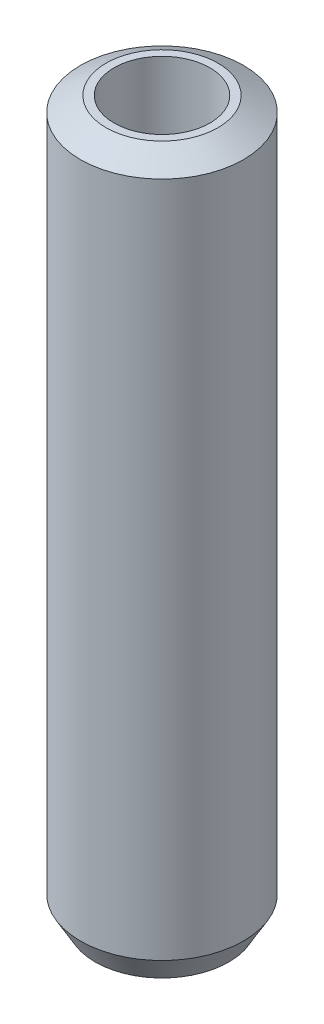
ISO-10303-21;
HEADER;
FILE_DESCRIPTION(('STEP AP214'),'2;1');
FILE_NAME('part.step','',(''),(''),'','','');
FILE_SCHEMA(('AUTOMOTIVE_DESIGN { 1 0 10303 214 1 1 1 1 }'));
ENDSEC;
DATA;
#1=APPLICATION_CONTEXT('core data for automotive mechanical design processes');
#2=APPLICATION_PROTOCOL_DEFINITION('international standard','automotive_design',2000,#1);
#3=PRODUCT_CONTEXT('',#1,'mechanical');
#4=PRODUCT('Part','Part','',(#3));
#5=PRODUCT_RELATED_PRODUCT_CATEGORY('part','',(#4));
#6=PRODUCT_DEFINITION_FORMATION('','',#4);
#7=PRODUCT_DEFINITION_CONTEXT('part definition',#1,'design');
#8=PRODUCT_DEFINITION('design','',#6,#7);
#9=PRODUCT_DEFINITION_SHAPE('','',#8);
#10=(LENGTH_UNIT() NAMED_UNIT(*) SI_UNIT(.MILLI.,.METRE.));
#11=(NAMED_UNIT(*) PLANE_ANGLE_UNIT() SI_UNIT($,.RADIAN.));
#12=(NAMED_UNIT(*) SI_UNIT($,.STERADIAN.) SOLID_ANGLE_UNIT());
#13=UNCERTAINTY_MEASURE_WITH_UNIT(LENGTH_MEASURE(1.E-05),#10,'distance_accuracy_value','');
#14=(GEOMETRIC_REPRESENTATION_CONTEXT(3) GLOBAL_UNCERTAINTY_ASSIGNED_CONTEXT((#13)) GLOBAL_UNIT_ASSIGNED_CONTEXT((#10,
#11,#12)) REPRESENTATION_CONTEXT('',''));
#15=CARTESIAN_POINT('',(0.,0.,0.));
#16=DIRECTION('',(0.,0.,1.));
#17=DIRECTION('',(1.,0.,0.));
#18=AXIS2_PLACEMENT_3D('',#15,#16,#17);
#19=CARTESIAN_POINT('',(0.,65.9212495967233,0.));
#20=DIRECTION('',(0.,-1.,0.));
#21=DIRECTION('',(0.,0.,-1.));
#22=AXIS2_PLACEMENT_3D('',#19,#20,#21);
#23=CYLINDRICAL_SURFACE('',#22,7.5);
#24=CARTESIAN_POINT('',(0.,64.5613069497645,0.));
#25=DIRECTION('',(0.,1.,0.));
#26=DIRECTION('',(0.,0.,1.));
#27=AXIS2_PLACEMENT_3D('',#24,#25,#26);
#28=CIRCLE('',#27,7.5);
#29=CARTESIAN_POINT('',(0.,64.5613069497645,7.5));
#30=VERTEX_POINT('',#29);
#31=EDGE_CURVE('E50',#30,#30,#28,.F.);
#32=ORIENTED_EDGE('',*,*,#31,.T.);
#33=EDGE_LOOP('',(#32));
#34=FACE_BOUND('',#33,.T.);
#35=CARTESIAN_POINT('',(0.,2.35548975991236,0.));
#36=DIRECTION('',(0.,1.,0.));
#37=DIRECTION('',(0.,0.,1.));
#38=AXIS2_PLACEMENT_3D('',#35,#36,#37);
#39=CIRCLE('',#38,7.5);
#40=CARTESIAN_POINT('',(0.,2.35548975991236,7.5));
#41=VERTEX_POINT('',#40);
#42=EDGE_CURVE('E51',#41,#41,#39,.T.);
#43=ORIENTED_EDGE('',*,*,#42,.T.);
#44=EDGE_LOOP('',(#43));
#45=FACE_BOUND('',#44,.T.);
#46=ADVANCED_FACE('F39',(#34,#45),#23,.T.);
#47=CARTESIAN_POINT('',(0.,65.9212495967233,0.));
#48=DIRECTION('',(0.,1.,0.));
#49=DIRECTION('',(0.,0.,1.));
#50=AXIS2_PLACEMENT_3D('',#47,#48,#49);
#51=PLANE('',#50);
#52=CARTESIAN_POINT('',(0.,65.9212495967233,0.));
#53=DIRECTION('',(0.,1.,0.));
#54=DIRECTION('',(0.,0.,1.));
#55=AXIS2_PLACEMENT_3D('',#52,#53,#54);
#56=CIRCLE('',#55,5.14451024008767);
#57=CARTESIAN_POINT('',(0.,65.9212495967233,5.14451024008767));
#58=VERTEX_POINT('',#57);
#59=EDGE_CURVE('E54',#58,#58,#56,.T.);
#60=ORIENTED_EDGE('',*,*,#59,.T.);
#61=EDGE_LOOP('',(#60));
#62=FACE_BOUND('',#61,.T.);
#63=CARTESIAN_POINT('',(0.,65.9212495967233,0.));
#64=DIRECTION('',(0.,1.,0.));
#65=DIRECTION('',(0.,0.,1.));
#66=AXIS2_PLACEMENT_3D('',#63,#64,#65);
#67=CIRCLE('',#66,4.40584892868654);
#68=CARTESIAN_POINT('',(0.,65.9212495967233,4.40584892868654));
#69=VERTEX_POINT('',#68);
#70=EDGE_CURVE('E58',#69,#69,#67,.T.);
#71=ORIENTED_EDGE('',*,*,#70,.F.);
#72=EDGE_LOOP('',(#71));
#73=FACE_BOUND('',#72,.T.);
#74=ADVANCED_FACE('F69',(#62,#73),#51,.T.);
#75=CARTESIAN_POINT('',(0.,0.,0.));
#76=DIRECTION('',(0.,1.,0.));
#77=DIRECTION('',(0.,0.,1.));
#78=AXIS2_PLACEMENT_3D('',#75,#76,#77);
#79=PLANE('',#78);
#80=CARTESIAN_POINT('',(0.,0.,0.));
#81=DIRECTION('',(0.,1.,0.));
#82=DIRECTION('',(0.,0.,1.));
#83=AXIS2_PLACEMENT_3D('',#80,#81,#82);
#84=CIRCLE('',#83,6.14005735304119);
#85=CARTESIAN_POINT('',(0.,0.,6.14005735304119));
#86=VERTEX_POINT('',#85);
#87=EDGE_CURVE('E10',#86,#86,#84,.F.);
#88=ORIENTED_EDGE('',*,*,#87,.T.);
#89=EDGE_LOOP('',(#88));
#90=FACE_BOUND('',#89,.T.);
#91=CARTESIAN_POINT('',(0.,0.,0.));
#92=DIRECTION('',(0.,1.,0.));
#93=DIRECTION('',(0.,0.,1.));
#94=AXIS2_PLACEMENT_3D('',#91,#92,#93);
#95=CIRCLE('',#94,4.40584892868654);
#96=CARTESIAN_POINT('',(0.,0.,4.40584892868654));
#97=VERTEX_POINT('',#96);
#98=EDGE_CURVE('E63',#97,#97,#95,.T.);
#99=ORIENTED_EDGE('',*,*,#98,.T.);
#100=EDGE_LOOP('',(#99));
#101=FACE_BOUND('',#100,.T.);
#102=ADVANCED_FACE('F75',(#90,#101),#79,.F.);
#103=CARTESIAN_POINT('',(0.,65.9212495967233,0.));
#104=DIRECTION('',(0.,-1.,0.));
#105=DIRECTION('',(0.,0.,-1.));
#106=AXIS2_PLACEMENT_3D('',#103,#104,#105);
#107=CYLINDRICAL_SURFACE('',#106,4.40584892868654);
#108=ORIENTED_EDGE('',*,*,#70,.T.);
#109=EDGE_LOOP('',(#108));
#110=FACE_BOUND('',#109,.T.);
#111=ORIENTED_EDGE('',*,*,#98,.F.);
#112=EDGE_LOOP('',(#111));
#113=FACE_BOUND('',#112,.T.);
#114=ADVANCED_FACE('F70',(#110,#113),#107,.F.);
#115=CARTESIAN_POINT('',(0.,65.9212495967233,0.));
#116=DIRECTION('',(0.,-1.,0.));
#117=DIRECTION('',(0.,0.,-1.));
#118=AXIS2_PLACEMENT_3D('',#115,#116,#117);
#119=CONICAL_SURFACE('',#118,5.14451024008767,1.04719755119659);
#120=ORIENTED_EDGE('',*,*,#31,.F.);
#121=EDGE_LOOP('',(#120));
#122=FACE_BOUND('',#121,.T.);
#123=ORIENTED_EDGE('',*,*,#59,.F.);
#124=EDGE_LOOP('',(#123));
#125=FACE_BOUND('',#124,.T.);
#126=ADVANCED_FACE('F81',(#122,#125),#119,.T.);
#127=CARTESIAN_POINT('',(0.,2.35548975991236,0.));
#128=DIRECTION('',(0.,1.,0.));
#129=DIRECTION('',(0.,0.,1.));
#130=AXIS2_PLACEMENT_3D('',#127,#128,#129);
#131=CONICAL_SURFACE('',#130,7.5,0.523598775598301);
#132=ORIENTED_EDGE('',*,*,#87,.F.);
#133=EDGE_LOOP('',(#132));
#134=FACE_BOUND('',#133,.T.);
#135=ORIENTED_EDGE('',*,*,#42,.F.);
#136=EDGE_LOOP('',(#135));
#137=FACE_BOUND('',#136,.T.);
#138=ADVANCED_FACE('F45',(#134,#137),#131,.T.);
#139=CLOSED_SHELL('',(#46,#74,#102,#114,#126,#138));
#140=MANIFOLD_SOLID_BREP('B2',#139);
#141=ADVANCED_BREP_SHAPE_REPRESENTATION('',(#18,#140),#14);
#142=SHAPE_DEFINITION_REPRESENTATION(#9,#141);
ENDSEC;
END-ISO-10303-21;
